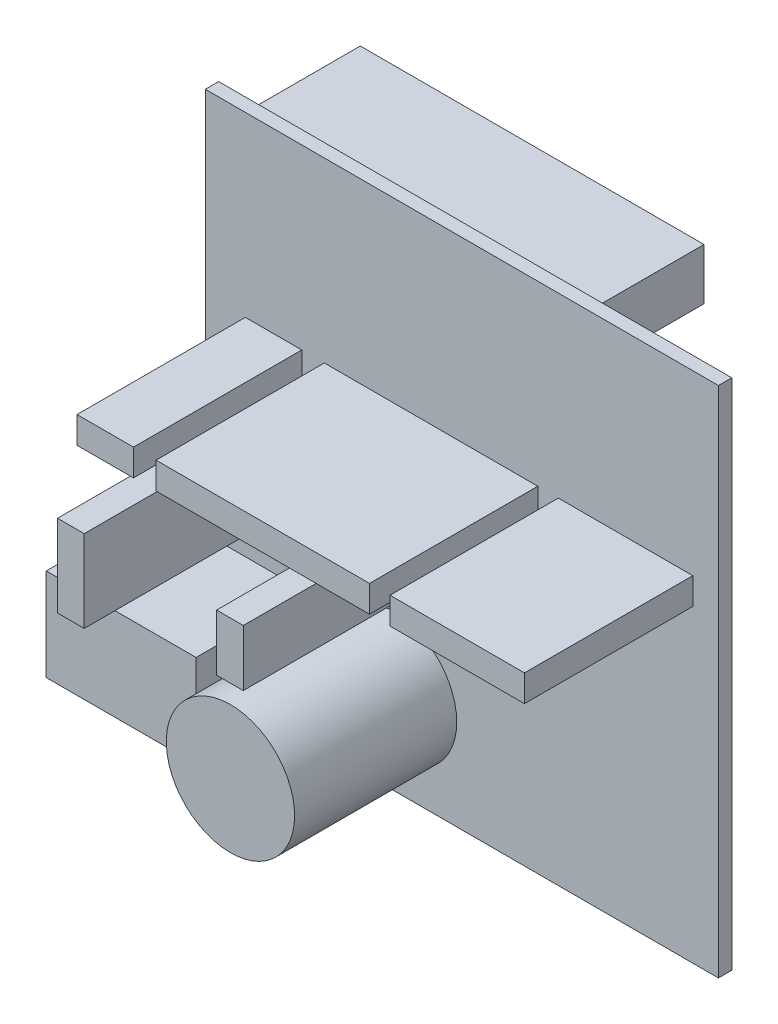
ISO-10303-21;
HEADER;
FILE_DESCRIPTION(('STEP AP214'),'2;1');
FILE_NAME('part.step','',(''),(''),'','','');
FILE_SCHEMA(('AUTOMOTIVE_DESIGN { 1 0 10303 214 1 1 1 1 }'));
ENDSEC;
DATA;
#1=APPLICATION_CONTEXT('core data for automotive mechanical design processes');
#2=APPLICATION_PROTOCOL_DEFINITION('international standard','automotive_design',2000,#1);
#3=PRODUCT_CONTEXT('',#1,'mechanical');
#4=PRODUCT('Part','Part','',(#3));
#5=PRODUCT_RELATED_PRODUCT_CATEGORY('part','',(#4));
#6=PRODUCT_DEFINITION_FORMATION('','',#4);
#7=PRODUCT_DEFINITION_CONTEXT('part definition',#1,'design');
#8=PRODUCT_DEFINITION('design','',#6,#7);
#9=PRODUCT_DEFINITION_SHAPE('','',#8);
#10=(LENGTH_UNIT() NAMED_UNIT(*) SI_UNIT(.MILLI.,.METRE.));
#11=(NAMED_UNIT(*) PLANE_ANGLE_UNIT() SI_UNIT($,.RADIAN.));
#12=(NAMED_UNIT(*) SI_UNIT($,.STERADIAN.) SOLID_ANGLE_UNIT());
#13=UNCERTAINTY_MEASURE_WITH_UNIT(LENGTH_MEASURE(1.E-05),#10,'distance_accuracy_value','');
#14=(GEOMETRIC_REPRESENTATION_CONTEXT(3) GLOBAL_UNCERTAINTY_ASSIGNED_CONTEXT((#13)) GLOBAL_UNIT_ASSIGNED_CONTEXT((#10,
#11,#12)) REPRESENTATION_CONTEXT('',''));
#15=CARTESIAN_POINT('',(0.,0.,0.));
#16=DIRECTION('',(0.,0.,1.));
#17=DIRECTION('',(1.,0.,0.));
#18=AXIS2_PLACEMENT_3D('',#15,#16,#17);
#19=CARTESIAN_POINT('',(0.,-50.,1.3));
#20=DIRECTION('',(0.,0.,1.));
#21=DIRECTION('',(1.,0.,0.));
#22=AXIS2_PLACEMENT_3D('',#19,#20,#21);
#23=PLANE('',#22);
#24=DIRECTION('',(1.,0.,0.));
#25=VECTOR('',#24,1.);
#26=CARTESIAN_POINT('',(2.,-35.,1.3));
#27=LINE('',#26,#25);
#28=CARTESIAN_POINT('',(2.,-35.,1.3));
#29=VERTEX_POINT('',#28);
#30=CARTESIAN_POINT('',(4.6,-35.,1.3));
#31=VERTEX_POINT('',#30);
#32=EDGE_CURVE('E277',#29,#31,#27,.T.);
#33=ORIENTED_EDGE('',*,*,#32,.F.);
#34=DIRECTION('',(0.,-1.,0.));
#35=VECTOR('',#34,1.);
#36=CARTESIAN_POINT('',(2.,-27.,1.3));
#37=LINE('',#36,#35);
#38=CARTESIAN_POINT('',(2.,-27.,1.3));
#39=VERTEX_POINT('',#38);
#40=EDGE_CURVE('E274',#39,#29,#37,.T.);
#41=ORIENTED_EDGE('',*,*,#40,.F.);
#42=DIRECTION('',(-1.,0.,0.));
#43=VECTOR('',#42,1.);
#44=CARTESIAN_POINT('',(2.,-27.,1.3));
#45=LINE('',#44,#43);
#46=CARTESIAN_POINT('',(4.6,-27.,1.3));
#47=VERTEX_POINT('',#46);
#48=EDGE_CURVE('E286',#47,#39,#45,.T.);
#49=ORIENTED_EDGE('',*,*,#48,.F.);
#50=DIRECTION('',(0.,1.,0.));
#51=VECTOR('',#50,1.);
#52=CARTESIAN_POINT('',(4.6,-27.,1.3));
#53=LINE('',#52,#51);
#54=EDGE_CURVE('E294',#31,#47,#53,.T.);
#55=ORIENTED_EDGE('',*,*,#54,.F.);
#56=EDGE_LOOP('',(#33,#41,#49,#55));
#57=FACE_BOUND('',#56,.T.);
#58=DIRECTION('',(-1.,0.,0.));
#59=VECTOR('',#58,1.);
#60=CARTESIAN_POINT('',(32.4,-17.3,1.3));
#61=LINE('',#60,#59);
#62=CARTESIAN_POINT('',(32.4,-17.3,1.3));
#63=VERTEX_POINT('',#62);
#64=CARTESIAN_POINT('',(11.6,-17.3,1.3));
#65=VERTEX_POINT('',#64);
#66=EDGE_CURVE('E348',#63,#65,#61,.T.);
#67=ORIENTED_EDGE('',*,*,#66,.F.);
#68=DIRECTION('',(0.,1.,0.));
#69=VECTOR('',#68,1.);
#70=CARTESIAN_POINT('',(32.4,-17.3,1.3));
#71=LINE('',#70,#69);
#72=CARTESIAN_POINT('',(32.4,-19.9,1.3));
#73=VERTEX_POINT('',#72);
#74=EDGE_CURVE('E334',#73,#63,#71,.T.);
#75=ORIENTED_EDGE('',*,*,#74,.F.);
#76=DIRECTION('',(1.,0.,0.));
#77=VECTOR('',#76,1.);
#78=CARTESIAN_POINT('',(32.4,-19.9,1.3));
#79=LINE('',#78,#77);
#80=CARTESIAN_POINT('',(11.6,-19.9,1.3));
#81=VERTEX_POINT('',#80);
#82=EDGE_CURVE('E339',#81,#73,#79,.T.);
#83=ORIENTED_EDGE('',*,*,#82,.F.);
#84=DIRECTION('',(0.,-1.,0.));
#85=VECTOR('',#84,1.);
#86=CARTESIAN_POINT('',(11.6,-17.3,1.3));
#87=LINE('',#86,#85);
#88=EDGE_CURVE('E350',#65,#81,#87,.T.);
#89=ORIENTED_EDGE('',*,*,#88,.F.);
#90=EDGE_LOOP('',(#67,#75,#83,#89));
#91=FACE_BOUND('',#90,.T.);
#92=CARTESIAN_POINT('',(18.25,-41.15,1.3));
#93=DIRECTION('',(0.,0.,1.));
#94=DIRECTION('',(1.,0.,0.));
#95=AXIS2_PLACEMENT_3D('',#92,#93,#94);
#96=CIRCLE('',#95,6.25);
#97=CARTESIAN_POINT('',(24.5,-41.15,1.3));
#98=VERTEX_POINT('',#97);
#99=EDGE_CURVE('E392',#98,#98,#96,.T.);
#100=ORIENTED_EDGE('',*,*,#99,.F.);
#101=EDGE_LOOP('',(#100));
#102=FACE_BOUND('',#101,.T.);
#103=DIRECTION('',(-1.,0.,0.));
#104=VECTOR('',#103,1.);
#105=CARTESIAN_POINT('',(-4.6,-37.5,1.3));
#106=LINE('',#105,#104);
#107=CARTESIAN_POINT('',(10.,-37.5,1.3));
#108=VERTEX_POINT('',#107);
#109=CARTESIAN_POINT('',(0.,-37.5,1.3));
#110=VERTEX_POINT('',#109);
#111=EDGE_CURVE('E403',#108,#110,#106,.T.);
#112=ORIENTED_EDGE('',*,*,#111,.F.);
#113=DIRECTION('',(0.,1.,0.));
#114=VECTOR('',#113,1.);
#115=CARTESIAN_POINT('',(10.,-46.5,1.3));
#116=LINE('',#115,#114);
#117=CARTESIAN_POINT('',(10.,-46.5,1.3));
#118=VERTEX_POINT('',#117);
#119=EDGE_CURVE('E413',#118,#108,#116,.T.);
#120=ORIENTED_EDGE('',*,*,#119,.F.);
#121=DIRECTION('',(1.,0.,0.));
#122=VECTOR('',#121,1.);
#123=CARTESIAN_POINT('',(-4.6,-46.5,1.3));
#124=LINE('',#123,#122);
#125=CARTESIAN_POINT('',(0.,-46.5,1.3));
#126=VERTEX_POINT('',#125);
#127=EDGE_CURVE('E11',#126,#118,#124,.T.);
#128=ORIENTED_EDGE('',*,*,#127,.F.);
#129=DIRECTION('',(0.,-1.,0.));
#130=VECTOR('',#129,1.);
#131=CARTESIAN_POINT('',(0.,0.,1.3));
#132=LINE('',#131,#130);
#133=CARTESIAN_POINT('',(0.,-50.,1.3));
#134=VERTEX_POINT('',#133);
#135=EDGE_CURVE('E469',#126,#134,#132,.T.);
#136=ORIENTED_EDGE('',*,*,#135,.T.);
#137=DIRECTION('',(1.,0.,0.));
#138=VECTOR('',#137,1.);
#139=CARTESIAN_POINT('',(0.,-50.,1.3));
#140=LINE('',#139,#138);
#141=CARTESIAN_POINT('',(50.,-50.,1.3));
#142=VERTEX_POINT('',#141);
#143=EDGE_CURVE('E467',#134,#142,#140,.T.);
#144=ORIENTED_EDGE('',*,*,#143,.T.);
#145=DIRECTION('',(0.,1.,0.));
#146=VECTOR('',#145,1.);
#147=CARTESIAN_POINT('',(50.,0.,1.3));
#148=LINE('',#147,#146);
#149=CARTESIAN_POINT('',(50.,0.,1.3));
#150=VERTEX_POINT('',#149);
#151=EDGE_CURVE('E471',#142,#150,#148,.T.);
#152=ORIENTED_EDGE('',*,*,#151,.T.);
#153=DIRECTION('',(-1.,0.,0.));
#154=VECTOR('',#153,1.);
#155=CARTESIAN_POINT('',(0.,0.,1.3));
#156=LINE('',#155,#154);
#157=CARTESIAN_POINT('',(0.,0.,1.3));
#158=VERTEX_POINT('',#157);
#159=EDGE_CURVE('E473',#150,#158,#156,.T.);
#160=ORIENTED_EDGE('',*,*,#159,.T.);
#161=EDGE_CURVE('E464',#158,#110,#132,.T.);
#162=ORIENTED_EDGE('',*,*,#161,.T.);
#163=EDGE_LOOP('',(#112,#120,#128,#136,#144,#152,#160,#162));
#164=FACE_BOUND('',#163,.T.);
#165=DIRECTION('',(-1.,0.,0.));
#166=VECTOR('',#165,1.);
#167=CARTESIAN_POINT('',(47.5,-17.3,1.3));
#168=LINE('',#167,#166);
#169=CARTESIAN_POINT('',(47.5,-17.3,1.3));
#170=VERTEX_POINT('',#169);
#171=CARTESIAN_POINT('',(34.4,-17.3,1.3));
#172=VERTEX_POINT('',#171);
#173=EDGE_CURVE('E377',#170,#172,#168,.T.);
#174=ORIENTED_EDGE('',*,*,#173,.F.);
#175=DIRECTION('',(0.,1.,0.));
#176=VECTOR('',#175,1.);
#177=CARTESIAN_POINT('',(47.5,-17.3,1.3));
#178=LINE('',#177,#176);
#179=CARTESIAN_POINT('',(47.5,-19.9,1.3));
#180=VERTEX_POINT('',#179);
#181=EDGE_CURVE('E363',#180,#170,#178,.T.);
#182=ORIENTED_EDGE('',*,*,#181,.F.);
#183=DIRECTION('',(1.,0.,0.));
#184=VECTOR('',#183,1.);
#185=CARTESIAN_POINT('',(47.5,-19.9,1.3));
#186=LINE('',#185,#184);
#187=CARTESIAN_POINT('',(34.4,-19.9,1.3));
#188=VERTEX_POINT('',#187);
#189=EDGE_CURVE('E368',#188,#180,#186,.T.);
#190=ORIENTED_EDGE('',*,*,#189,.F.);
#191=DIRECTION('',(0.,-1.,0.));
#192=VECTOR('',#191,1.);
#193=CARTESIAN_POINT('',(34.4,-17.3,1.3));
#194=LINE('',#193,#192);
#195=EDGE_CURVE('E379',#172,#188,#194,.T.);
#196=ORIENTED_EDGE('',*,*,#195,.F.);
#197=EDGE_LOOP('',(#174,#182,#190,#196));
#198=FACE_BOUND('',#197,.T.);
#199=DIRECTION('',(-1.,0.,0.));
#200=VECTOR('',#199,1.);
#201=CARTESIAN_POINT('',(9.40000000000001,-17.3,1.3));
#202=LINE('',#201,#200);
#203=CARTESIAN_POINT('',(9.40000000000001,-17.3,1.3));
#204=VERTEX_POINT('',#203);
#205=CARTESIAN_POINT('',(3.90000000000001,-17.3,1.3));
#206=VERTEX_POINT('',#205);
#207=EDGE_CURVE('E319',#204,#206,#202,.T.);
#208=ORIENTED_EDGE('',*,*,#207,.F.);
#209=DIRECTION('',(0.,1.,0.));
#210=VECTOR('',#209,1.);
#211=CARTESIAN_POINT('',(9.40000000000001,-17.3,1.3));
#212=LINE('',#211,#210);
#213=CARTESIAN_POINT('',(9.40000000000001,-19.9,1.3));
#214=VERTEX_POINT('',#213);
#215=EDGE_CURVE('E305',#214,#204,#212,.T.);
#216=ORIENTED_EDGE('',*,*,#215,.F.);
#217=DIRECTION('',(1.,0.,0.));
#218=VECTOR('',#217,1.);
#219=CARTESIAN_POINT('',(9.40000000000001,-19.9,1.3));
#220=LINE('',#219,#218);
#221=CARTESIAN_POINT('',(3.90000000000001,-19.9,1.3));
#222=VERTEX_POINT('',#221);
#223=EDGE_CURVE('E310',#222,#214,#220,.T.);
#224=ORIENTED_EDGE('',*,*,#223,.F.);
#225=DIRECTION('',(0.,-1.,0.));
#226=VECTOR('',#225,1.);
#227=CARTESIAN_POINT('',(3.90000000000001,-17.3,1.3));
#228=LINE('',#227,#226);
#229=EDGE_CURVE('E321',#206,#222,#228,.T.);
#230=ORIENTED_EDGE('',*,*,#229,.F.);
#231=EDGE_LOOP('',(#208,#216,#224,#230));
#232=FACE_BOUND('',#231,.T.);
#233=DIRECTION('',(1.,0.,0.));
#234=VECTOR('',#233,1.);
#235=CARTESIAN_POINT('',(17.5,-32.5,1.3));
#236=LINE('',#235,#234);
#237=CARTESIAN_POINT('',(17.5,-32.5,1.3));
#238=VERTEX_POINT('',#237);
#239=CARTESIAN_POINT('',(20.1,-32.5,1.3));
#240=VERTEX_POINT('',#239);
#241=EDGE_CURVE('E933',#238,#240,#236,.T.);
#242=ORIENTED_EDGE('',*,*,#241,.F.);
#243=DIRECTION('',(0.,-1.,0.));
#244=VECTOR('',#243,1.);
#245=CARTESIAN_POINT('',(17.5,-27.,1.3));
#246=LINE('',#245,#244);
#247=CARTESIAN_POINT('',(17.5,-27.,1.3));
#248=VERTEX_POINT('',#247);
#249=EDGE_CURVE('E272',#248,#238,#246,.T.);
#250=ORIENTED_EDGE('',*,*,#249,.F.);
#251=DIRECTION('',(-1.,0.,0.));
#252=VECTOR('',#251,1.);
#253=CARTESIAN_POINT('',(17.5,-27.,1.3));
#254=LINE('',#253,#252);
#255=CARTESIAN_POINT('',(20.1,-27.,1.3));
#256=VERTEX_POINT('',#255);
#257=EDGE_CURVE('E268',#256,#248,#254,.T.);
#258=ORIENTED_EDGE('',*,*,#257,.F.);
#259=DIRECTION('',(0.,1.,0.));
#260=VECTOR('',#259,1.);
#261=CARTESIAN_POINT('',(20.1,-27.,1.3));
#262=LINE('',#261,#260);
#263=EDGE_CURVE('E930',#240,#256,#262,.T.);
#264=ORIENTED_EDGE('',*,*,#263,.F.);
#265=EDGE_LOOP('',(#242,#250,#258,#264));
#266=FACE_BOUND('',#265,.T.);
#267=ADVANCED_FACE('F31',(#57,#91,#102,#164,#198,#232,#266),#23,.T.);
#268=CARTESIAN_POINT('',(0.,-50.,0.));
#269=DIRECTION('',(0.,0.,1.));
#270=DIRECTION('',(1.,0.,0.));
#271=AXIS2_PLACEMENT_3D('',#268,#269,#270);
#272=PLANE('',#271);
#273=DIRECTION('',(0.,-1.,0.));
#274=VECTOR('',#273,1.);
#275=CARTESIAN_POINT('',(0.,0.,0.));
#276=LINE('',#275,#274);
#277=CARTESIAN_POINT('',(0.,0.,0.));
#278=VERTEX_POINT('',#277);
#279=CARTESIAN_POINT('',(0.,-50.,0.));
#280=VERTEX_POINT('',#279);
#281=EDGE_CURVE('E463',#278,#280,#276,.T.);
#282=ORIENTED_EDGE('',*,*,#281,.F.);
#283=DIRECTION('',(-1.,0.,0.));
#284=VECTOR('',#283,1.);
#285=CARTESIAN_POINT('',(0.,0.,0.));
#286=LINE('',#285,#284);
#287=CARTESIAN_POINT('',(50.,0.,0.));
#288=VERTEX_POINT('',#287);
#289=EDGE_CURVE('E482',#288,#278,#286,.T.);
#290=ORIENTED_EDGE('',*,*,#289,.F.);
#291=DIRECTION('',(0.,1.,0.));
#292=VECTOR('',#291,1.);
#293=CARTESIAN_POINT('',(50.,0.,0.));
#294=LINE('',#293,#292);
#295=CARTESIAN_POINT('',(50.,-50.,0.));
#296=VERTEX_POINT('',#295);
#297=EDGE_CURVE('E480',#296,#288,#294,.T.);
#298=ORIENTED_EDGE('',*,*,#297,.F.);
#299=DIRECTION('',(1.,0.,0.));
#300=VECTOR('',#299,1.);
#301=CARTESIAN_POINT('',(0.,-50.,0.));
#302=LINE('',#301,#300);
#303=EDGE_CURVE('E478',#280,#296,#302,.T.);
#304=ORIENTED_EDGE('',*,*,#303,.F.);
#305=EDGE_LOOP('',(#282,#290,#298,#304));
#306=FACE_BOUND('',#305,.T.);
#307=DIRECTION('',(0.,1.,0.));
#308=VECTOR('',#307,1.);
#309=CARTESIAN_POINT('',(2.7,-1.2,0.));
#310=LINE('',#309,#308);
#311=CARTESIAN_POINT('',(2.7,-6.2,0.));
#312=VERTEX_POINT('',#311);
#313=CARTESIAN_POINT('',(2.7,-1.2,0.));
#314=VERTEX_POINT('',#313);
#315=EDGE_CURVE('E430',#312,#314,#310,.T.);
#316=ORIENTED_EDGE('',*,*,#315,.F.);
#317=DIRECTION('',(-1.,0.,0.));
#318=VECTOR('',#317,1.);
#319=CARTESIAN_POINT('',(2.7,-6.2,0.));
#320=LINE('',#319,#318);
#321=CARTESIAN_POINT('',(36.2,-6.2,0.));
#322=VERTEX_POINT('',#321);
#323=EDGE_CURVE('E435',#322,#312,#320,.T.);
#324=ORIENTED_EDGE('',*,*,#323,.F.);
#325=DIRECTION('',(0.,-1.,0.));
#326=VECTOR('',#325,1.);
#327=CARTESIAN_POINT('',(36.2,-1.2,0.));
#328=LINE('',#327,#326);
#329=CARTESIAN_POINT('',(36.2,-1.20000000000001,0.));
#330=VERTEX_POINT('',#329);
#331=EDGE_CURVE('E447',#330,#322,#328,.T.);
#332=ORIENTED_EDGE('',*,*,#331,.F.);
#333=DIRECTION('',(1.,0.,0.));
#334=VECTOR('',#333,1.);
#335=CARTESIAN_POINT('',(2.7,-1.2,0.));
#336=LINE('',#335,#334);
#337=EDGE_CURVE('E444',#314,#330,#336,.T.);
#338=ORIENTED_EDGE('',*,*,#337,.F.);
#339=EDGE_LOOP('',(#316,#324,#332,#338));
#340=FACE_BOUND('',#339,.T.);
#341=ADVANCED_FACE('F506',(#306,#340),#272,.F.);
#342=CARTESIAN_POINT('',(0.,0.,1.3));
#343=DIRECTION('',(1.,0.,0.));
#344=DIRECTION('',(0.,1.,0.));
#345=AXIS2_PLACEMENT_3D('',#342,#343,#344);
#346=PLANE('',#345);
#347=ORIENTED_EDGE('',*,*,#281,.T.);
#348=DIRECTION('',(0.,0.,-1.));
#349=VECTOR('',#348,1.);
#350=CARTESIAN_POINT('',(0.,-50.,1.3));
#351=LINE('',#350,#349);
#352=EDGE_CURVE('E35',#134,#280,#351,.T.);
#353=ORIENTED_EDGE('',*,*,#352,.F.);
#354=ORIENTED_EDGE('',*,*,#135,.F.);
#355=EDGE_CURVE('E468',#110,#126,#132,.T.);
#356=ORIENTED_EDGE('',*,*,#355,.F.);
#357=ORIENTED_EDGE('',*,*,#161,.F.);
#358=DIRECTION('',(0.,0.,-1.));
#359=VECTOR('',#358,1.);
#360=CARTESIAN_POINT('',(0.,0.,1.3));
#361=LINE('',#360,#359);
#362=EDGE_CURVE('E475',#158,#278,#361,.T.);
#363=ORIENTED_EDGE('',*,*,#362,.T.);
#364=EDGE_LOOP('',(#347,#353,#354,#356,#357,#363));
#365=FACE_BOUND('',#364,.T.);
#366=ADVANCED_FACE('F33',(#365),#346,.F.);
#367=CARTESIAN_POINT('',(0.,-50.,1.3));
#368=DIRECTION('',(0.,1.,0.));
#369=DIRECTION('',(0.,0.,1.));
#370=AXIS2_PLACEMENT_3D('',#367,#368,#369);
#371=PLANE('',#370);
#372=ORIENTED_EDGE('',*,*,#303,.T.);
#373=DIRECTION('',(0.,0.,-1.));
#374=VECTOR('',#373,1.);
#375=CARTESIAN_POINT('',(50.,-50.,1.3));
#376=LINE('',#375,#374);
#377=EDGE_CURVE('E488',#142,#296,#376,.T.);
#378=ORIENTED_EDGE('',*,*,#377,.F.);
#379=ORIENTED_EDGE('',*,*,#143,.F.);
#380=ORIENTED_EDGE('',*,*,#352,.T.);
#381=EDGE_LOOP('',(#372,#378,#379,#380));
#382=FACE_BOUND('',#381,.T.);
#383=ADVANCED_FACE('F498',(#382),#371,.F.);
#384=CARTESIAN_POINT('',(50.,0.,1.3));
#385=DIRECTION('',(-1.,0.,0.));
#386=DIRECTION('',(0.,-1.,0.));
#387=AXIS2_PLACEMENT_3D('',#384,#385,#386);
#388=PLANE('',#387);
#389=ORIENTED_EDGE('',*,*,#297,.T.);
#390=DIRECTION('',(0.,0.,-1.));
#391=VECTOR('',#390,1.);
#392=CARTESIAN_POINT('',(50.,0.,1.3));
#393=LINE('',#392,#391);
#394=EDGE_CURVE('E486',#150,#288,#393,.T.);
#395=ORIENTED_EDGE('',*,*,#394,.F.);
#396=ORIENTED_EDGE('',*,*,#151,.F.);
#397=ORIENTED_EDGE('',*,*,#377,.T.);
#398=EDGE_LOOP('',(#389,#395,#396,#397));
#399=FACE_BOUND('',#398,.T.);
#400=ADVANCED_FACE('F509',(#399),#388,.F.);
#401=CARTESIAN_POINT('',(0.,0.,1.3));
#402=DIRECTION('',(0.,-1.,0.));
#403=DIRECTION('',(0.,0.,-1.));
#404=AXIS2_PLACEMENT_3D('',#401,#402,#403);
#405=PLANE('',#404);
#406=ORIENTED_EDGE('',*,*,#289,.T.);
#407=ORIENTED_EDGE('',*,*,#362,.F.);
#408=ORIENTED_EDGE('',*,*,#159,.F.);
#409=ORIENTED_EDGE('',*,*,#394,.T.);
#410=EDGE_LOOP('',(#406,#407,#408,#409));
#411=FACE_BOUND('',#410,.T.);
#412=ADVANCED_FACE('F512',(#411),#405,.F.);
#413=CARTESIAN_POINT('',(2.7,-1.2,-11.1));
#414=DIRECTION('',(1.,0.,0.));
#415=DIRECTION('',(0.,1.,0.));
#416=AXIS2_PLACEMENT_3D('',#413,#414,#415);
#417=PLANE('',#416);
#418=ORIENTED_EDGE('',*,*,#315,.T.);
#419=DIRECTION('',(0.,0.,1.));
#420=VECTOR('',#419,1.);
#421=CARTESIAN_POINT('',(2.7,-1.2,-11.1));
#422=LINE('',#421,#420);
#423=CARTESIAN_POINT('',(2.7,-1.2,-11.1));
#424=VERTEX_POINT('',#423);
#425=EDGE_CURVE('E460',#424,#314,#422,.T.);
#426=ORIENTED_EDGE('',*,*,#425,.F.);
#427=DIRECTION('',(0.,1.,0.));
#428=VECTOR('',#427,1.);
#429=CARTESIAN_POINT('',(2.7,-1.2,-11.1));
#430=LINE('',#429,#428);
#431=CARTESIAN_POINT('',(2.7,-6.2,-11.1));
#432=VERTEX_POINT('',#431);
#433=EDGE_CURVE('E431',#432,#424,#430,.T.);
#434=ORIENTED_EDGE('',*,*,#433,.F.);
#435=DIRECTION('',(0.,0.,1.));
#436=VECTOR('',#435,1.);
#437=CARTESIAN_POINT('',(2.7,-6.2,-11.1));
#438=LINE('',#437,#436);
#439=EDGE_CURVE('E441',#432,#312,#438,.T.);
#440=ORIENTED_EDGE('',*,*,#439,.T.);
#441=EDGE_LOOP('',(#418,#426,#434,#440));
#442=FACE_BOUND('',#441,.T.);
#443=ADVANCED_FACE('F557',(#442),#417,.F.);
#444=CARTESIAN_POINT('',(2.7,-1.2,-11.1));
#445=DIRECTION('',(0.,-1.,0.));
#446=DIRECTION('',(1.,0.,0.));
#447=AXIS2_PLACEMENT_3D('',#444,#445,#446);
#448=PLANE('',#447);
#449=ORIENTED_EDGE('',*,*,#337,.T.);
#450=DIRECTION('',(0.,0.,1.));
#451=VECTOR('',#450,1.);
#452=CARTESIAN_POINT('',(36.2,-1.2,-11.1));
#453=LINE('',#452,#451);
#454=CARTESIAN_POINT('',(36.2,-1.2,-11.1));
#455=VERTEX_POINT('',#454);
#456=EDGE_CURVE('E457',#455,#330,#453,.T.);
#457=ORIENTED_EDGE('',*,*,#456,.F.);
#458=DIRECTION('',(1.,0.,0.));
#459=VECTOR('',#458,1.);
#460=CARTESIAN_POINT('',(2.7,-1.2,-11.1));
#461=LINE('',#460,#459);
#462=EDGE_CURVE('E434',#424,#455,#461,.T.);
#463=ORIENTED_EDGE('',*,*,#462,.F.);
#464=ORIENTED_EDGE('',*,*,#425,.T.);
#465=EDGE_LOOP('',(#449,#457,#463,#464));
#466=FACE_BOUND('',#465,.T.);
#467=ADVANCED_FACE('F588',(#466),#448,.F.);
#468=CARTESIAN_POINT('',(36.2,-1.2,-11.1));
#469=DIRECTION('',(-1.,0.,0.));
#470=DIRECTION('',(0.,0.,1.));
#471=AXIS2_PLACEMENT_3D('',#468,#469,#470);
#472=PLANE('',#471);
#473=ORIENTED_EDGE('',*,*,#331,.T.);
#474=DIRECTION('',(0.,0.,1.));
#475=VECTOR('',#474,1.);
#476=CARTESIAN_POINT('',(36.2,-6.2,-11.1));
#477=LINE('',#476,#475);
#478=CARTESIAN_POINT('',(36.2,-6.2,-11.1));
#479=VERTEX_POINT('',#478);
#480=EDGE_CURVE('E454',#479,#322,#477,.T.);
#481=ORIENTED_EDGE('',*,*,#480,.F.);
#482=DIRECTION('',(0.,-1.,0.));
#483=VECTOR('',#482,1.);
#484=CARTESIAN_POINT('',(36.2,-1.2,-11.1));
#485=LINE('',#484,#483);
#486=EDGE_CURVE('E437',#455,#479,#485,.T.);
#487=ORIENTED_EDGE('',*,*,#486,.F.);
#488=ORIENTED_EDGE('',*,*,#456,.T.);
#489=EDGE_LOOP('',(#473,#481,#487,#488));
#490=FACE_BOUND('',#489,.T.);
#491=ADVANCED_FACE('F597',(#490),#472,.F.);
#492=CARTESIAN_POINT('',(2.7,-6.2,-11.1));
#493=DIRECTION('',(0.,1.,0.));
#494=DIRECTION('',(-1.,0.,0.));
#495=AXIS2_PLACEMENT_3D('',#492,#493,#494);
#496=PLANE('',#495);
#497=ORIENTED_EDGE('',*,*,#323,.T.);
#498=ORIENTED_EDGE('',*,*,#439,.F.);
#499=DIRECTION('',(-1.,0.,0.));
#500=VECTOR('',#499,1.);
#501=CARTESIAN_POINT('',(2.7,-6.2,-11.1));
#502=LINE('',#501,#500);
#503=EDGE_CURVE('E439',#479,#432,#502,.T.);
#504=ORIENTED_EDGE('',*,*,#503,.F.);
#505=ORIENTED_EDGE('',*,*,#480,.T.);
#506=EDGE_LOOP('',(#497,#498,#504,#505));
#507=FACE_BOUND('',#506,.T.);
#508=ADVANCED_FACE('F606',(#507),#496,.F.);
#509=CARTESIAN_POINT('',(2.7,-6.2,-11.1));
#510=DIRECTION('',(0.,0.,1.));
#511=DIRECTION('',(1.,0.,0.));
#512=AXIS2_PLACEMENT_3D('',#509,#510,#511);
#513=PLANE('',#512);
#514=ORIENTED_EDGE('',*,*,#433,.T.);
#515=ORIENTED_EDGE('',*,*,#462,.T.);
#516=ORIENTED_EDGE('',*,*,#486,.T.);
#517=ORIENTED_EDGE('',*,*,#503,.T.);
#518=EDGE_LOOP('',(#514,#515,#516,#517));
#519=FACE_BOUND('',#518,.T.);
#520=ADVANCED_FACE('F615',(#519),#513,.F.);
#521=CARTESIAN_POINT('',(-4.6,-46.5,12.2));
#522=DIRECTION('',(1.,0.,0.));
#523=DIRECTION('',(0.,0.,-1.));
#524=AXIS2_PLACEMENT_3D('',#521,#522,#523);
#525=PLANE('',#524);
#526=DIRECTION('',(0.,-1.,0.));
#527=VECTOR('',#526,1.);
#528=CARTESIAN_POINT('',(-4.6,-46.5,1.3));
#529=LINE('',#528,#527);
#530=CARTESIAN_POINT('',(-4.6,-37.5,1.3));
#531=VERTEX_POINT('',#530);
#532=CARTESIAN_POINT('',(-4.6,-46.5,1.3));
#533=VERTEX_POINT('',#532);
#534=EDGE_CURVE('E396',#531,#533,#529,.T.);
#535=ORIENTED_EDGE('',*,*,#534,.T.);
#536=DIRECTION('',(0.,0.,-1.));
#537=VECTOR('',#536,1.);
#538=CARTESIAN_POINT('',(-4.6,-46.5,12.2));
#539=LINE('',#538,#537);
#540=CARTESIAN_POINT('',(-4.6,-46.5,12.2));
#541=VERTEX_POINT('',#540);
#542=EDGE_CURVE('E427',#541,#533,#539,.T.);
#543=ORIENTED_EDGE('',*,*,#542,.F.);
#544=DIRECTION('',(0.,-1.,0.));
#545=VECTOR('',#544,1.);
#546=CARTESIAN_POINT('',(-4.6,-46.5,12.2));
#547=LINE('',#546,#545);
#548=CARTESIAN_POINT('',(-4.6,-37.5,12.2));
#549=VERTEX_POINT('',#548);
#550=EDGE_CURVE('E399',#549,#541,#547,.T.);
#551=ORIENTED_EDGE('',*,*,#550,.F.);
#552=DIRECTION('',(0.,0.,-1.));
#553=VECTOR('',#552,1.);
#554=CARTESIAN_POINT('',(-4.6,-37.5,12.2));
#555=LINE('',#554,#553);
#556=EDGE_CURVE('E409',#549,#531,#555,.T.);
#557=ORIENTED_EDGE('',*,*,#556,.T.);
#558=EDGE_LOOP('',(#535,#543,#551,#557));
#559=FACE_BOUND('',#558,.T.);
#560=ADVANCED_FACE('F526',(#559),#525,.F.);
#561=CARTESIAN_POINT('',(-4.6,-46.5,12.2));
#562=DIRECTION('',(0.,1.,0.));
#563=DIRECTION('',(0.,0.,1.));
#564=AXIS2_PLACEMENT_3D('',#561,#562,#563);
#565=PLANE('',#564);
#566=EDGE_CURVE('E41',#533,#126,#124,.T.);
#567=ORIENTED_EDGE('',*,*,#566,.T.);
#568=ORIENTED_EDGE('',*,*,#127,.T.);
#569=DIRECTION('',(0.,0.,-1.));
#570=VECTOR('',#569,1.);
#571=CARTESIAN_POINT('',(10.,-46.5,12.2));
#572=LINE('',#571,#570);
#573=CARTESIAN_POINT('',(10.,-46.5,12.2));
#574=VERTEX_POINT('',#573);
#575=EDGE_CURVE('E424',#574,#118,#572,.T.);
#576=ORIENTED_EDGE('',*,*,#575,.F.);
#577=DIRECTION('',(1.,0.,0.));
#578=VECTOR('',#577,1.);
#579=CARTESIAN_POINT('',(-4.6,-46.5,12.2));
#580=LINE('',#579,#578);
#581=EDGE_CURVE('E402',#541,#574,#580,.T.);
#582=ORIENTED_EDGE('',*,*,#581,.F.);
#583=ORIENTED_EDGE('',*,*,#542,.T.);
#584=EDGE_LOOP('',(#567,#568,#576,#582,#583));
#585=FACE_BOUND('',#584,.T.);
#586=ADVANCED_FACE('F521',(#585),#565,.F.);
#587=CARTESIAN_POINT('',(10.,-46.5,12.2));
#588=DIRECTION('',(-1.,0.,0.));
#589=DIRECTION('',(0.,0.,1.));
#590=AXIS2_PLACEMENT_3D('',#587,#588,#589);
#591=PLANE('',#590);
#592=ORIENTED_EDGE('',*,*,#119,.T.);
#593=DIRECTION('',(0.,0.,-1.));
#594=VECTOR('',#593,1.);
#595=CARTESIAN_POINT('',(10.,-37.5,12.2));
#596=LINE('',#595,#594);
#597=CARTESIAN_POINT('',(10.,-37.5,12.2));
#598=VERTEX_POINT('',#597);
#599=EDGE_CURVE('E421',#598,#108,#596,.T.);
#600=ORIENTED_EDGE('',*,*,#599,.F.);
#601=DIRECTION('',(0.,1.,0.));
#602=VECTOR('',#601,1.);
#603=CARTESIAN_POINT('',(10.,-46.5,12.2));
#604=LINE('',#603,#602);
#605=EDGE_CURVE('E405',#574,#598,#604,.T.);
#606=ORIENTED_EDGE('',*,*,#605,.F.);
#607=ORIENTED_EDGE('',*,*,#575,.T.);
#608=EDGE_LOOP('',(#592,#600,#606,#607));
#609=FACE_BOUND('',#608,.T.);
#610=ADVANCED_FACE('F533',(#609),#591,.F.);
#611=CARTESIAN_POINT('',(-4.6,-37.5,12.2));
#612=DIRECTION('',(0.,-1.,0.));
#613=DIRECTION('',(0.,0.,-1.));
#614=AXIS2_PLACEMENT_3D('',#611,#612,#613);
#615=PLANE('',#614);
#616=ORIENTED_EDGE('',*,*,#111,.T.);
#617=EDGE_CURVE('E416',#110,#531,#106,.T.);
#618=ORIENTED_EDGE('',*,*,#617,.T.);
#619=ORIENTED_EDGE('',*,*,#556,.F.);
#620=DIRECTION('',(-1.,0.,0.));
#621=VECTOR('',#620,1.);
#622=CARTESIAN_POINT('',(-4.6,-37.5,12.2));
#623=LINE('',#622,#621);
#624=EDGE_CURVE('E407',#598,#549,#623,.T.);
#625=ORIENTED_EDGE('',*,*,#624,.F.);
#626=ORIENTED_EDGE('',*,*,#599,.T.);
#627=EDGE_LOOP('',(#616,#618,#619,#625,#626));
#628=FACE_BOUND('',#627,.T.);
#629=ADVANCED_FACE('F530',(#628),#615,.F.);
#630=CARTESIAN_POINT('',(-4.6,-37.5,12.2));
#631=DIRECTION('',(0.,0.,-1.));
#632=DIRECTION('',(-1.,0.,0.));
#633=AXIS2_PLACEMENT_3D('',#630,#631,#632);
#634=PLANE('',#633);
#635=ORIENTED_EDGE('',*,*,#550,.T.);
#636=ORIENTED_EDGE('',*,*,#581,.T.);
#637=ORIENTED_EDGE('',*,*,#605,.T.);
#638=ORIENTED_EDGE('',*,*,#624,.T.);
#639=EDGE_LOOP('',(#635,#636,#637,#638));
#640=FACE_BOUND('',#639,.T.);
#641=ADVANCED_FACE('F536',(#640),#634,.F.);
#642=CARTESIAN_POINT('',(-4.6,-37.5,1.3));
#643=DIRECTION('',(0.,0.,-1.));
#644=DIRECTION('',(-1.,0.,0.));
#645=AXIS2_PLACEMENT_3D('',#642,#643,#644);
#646=PLANE('',#645);
#647=ORIENTED_EDGE('',*,*,#617,.F.);
#648=ORIENTED_EDGE('',*,*,#355,.T.);
#649=ORIENTED_EDGE('',*,*,#566,.F.);
#650=ORIENTED_EDGE('',*,*,#534,.F.);
#651=EDGE_LOOP('',(#647,#648,#649,#650));
#652=FACE_BOUND('',#651,.T.);
#653=ADVANCED_FACE('F518',(#652),#646,.T.);
#654=CARTESIAN_POINT('',(18.25,-41.15,17.1));
#655=DIRECTION('',(0.,0.,-1.));
#656=DIRECTION('',(-1.,0.,0.));
#657=AXIS2_PLACEMENT_3D('',#654,#655,#656);
#658=CYLINDRICAL_SURFACE('',#657,6.25);
#659=CARTESIAN_POINT('',(18.25,-41.15,17.1));
#660=DIRECTION('',(0.,0.,1.));
#661=DIRECTION('',(1.,0.,0.));
#662=AXIS2_PLACEMENT_3D('',#659,#660,#661);
#663=CIRCLE('',#662,6.25);
#664=CARTESIAN_POINT('',(24.5,-41.15,17.1));
#665=VERTEX_POINT('',#664);
#666=EDGE_CURVE('E393',#665,#665,#663,.T.);
#667=ORIENTED_EDGE('',*,*,#666,.F.);
#668=EDGE_LOOP('',(#667));
#669=FACE_BOUND('',#668,.T.);
#670=ORIENTED_EDGE('',*,*,#99,.T.);
#671=EDGE_LOOP('',(#670));
#672=FACE_BOUND('',#671,.T.);
#673=ADVANCED_FACE('F543',(#669,#672),#658,.T.);
#674=CARTESIAN_POINT('',(18.25,-41.15,17.1));
#675=DIRECTION('',(0.,0.,1.));
#676=DIRECTION('',(1.,0.,0.));
#677=AXIS2_PLACEMENT_3D('',#674,#675,#676);
#678=PLANE('',#677);
#679=ORIENTED_EDGE('',*,*,#666,.T.);
#680=EDGE_LOOP('',(#679));
#681=FACE_BOUND('',#680,.T.);
#682=ADVANCED_FACE('F667',(#681),#678,.T.);
#683=CARTESIAN_POINT('',(47.5,-17.3,17.7));
#684=DIRECTION('',(-1.,0.,0.));
#685=DIRECTION('',(0.,0.,1.));
#686=AXIS2_PLACEMENT_3D('',#683,#684,#685);
#687=PLANE('',#686);
#688=ORIENTED_EDGE('',*,*,#181,.T.);
#689=DIRECTION('',(0.,0.,-1.));
#690=VECTOR('',#689,1.);
#691=CARTESIAN_POINT('',(47.5,-17.3,17.7));
#692=LINE('',#691,#690);
#693=CARTESIAN_POINT('',(47.5,-17.3,17.7));
#694=VERTEX_POINT('',#693);
#695=EDGE_CURVE('E390',#694,#170,#692,.T.);
#696=ORIENTED_EDGE('',*,*,#695,.F.);
#697=DIRECTION('',(0.,1.,0.));
#698=VECTOR('',#697,1.);
#699=CARTESIAN_POINT('',(47.5,-17.3,17.7));
#700=LINE('',#699,#698);
#701=CARTESIAN_POINT('',(47.5,-19.9,17.7));
#702=VERTEX_POINT('',#701);
#703=EDGE_CURVE('E364',#702,#694,#700,.T.);
#704=ORIENTED_EDGE('',*,*,#703,.F.);
#705=DIRECTION('',(0.,0.,-1.));
#706=VECTOR('',#705,1.);
#707=CARTESIAN_POINT('',(47.5,-19.9,17.7));
#708=LINE('',#707,#706);
#709=EDGE_CURVE('E374',#702,#180,#708,.T.);
#710=ORIENTED_EDGE('',*,*,#709,.T.);
#711=EDGE_LOOP('',(#688,#696,#704,#710));
#712=FACE_BOUND('',#711,.T.);
#713=ADVANCED_FACE('F675',(#712),#687,.F.);
#714=CARTESIAN_POINT('',(47.5,-17.3,17.7));
#715=DIRECTION('',(0.,-1.,0.));
#716=DIRECTION('',(0.,0.,-1.));
#717=AXIS2_PLACEMENT_3D('',#714,#715,#716);
#718=PLANE('',#717);
#719=ORIENTED_EDGE('',*,*,#173,.T.);
#720=DIRECTION('',(0.,0.,-1.));
#721=VECTOR('',#720,1.);
#722=CARTESIAN_POINT('',(34.4,-17.3,17.7));
#723=LINE('',#722,#721);
#724=CARTESIAN_POINT('',(34.4,-17.3,17.7));
#725=VERTEX_POINT('',#724);
#726=EDGE_CURVE('E387',#725,#172,#723,.T.);
#727=ORIENTED_EDGE('',*,*,#726,.F.);
#728=DIRECTION('',(-1.,0.,0.));
#729=VECTOR('',#728,1.);
#730=CARTESIAN_POINT('',(47.5,-17.3,17.7));
#731=LINE('',#730,#729);
#732=EDGE_CURVE('E367',#694,#725,#731,.T.);
#733=ORIENTED_EDGE('',*,*,#732,.F.);
#734=ORIENTED_EDGE('',*,*,#695,.T.);
#735=EDGE_LOOP('',(#719,#727,#733,#734));
#736=FACE_BOUND('',#735,.T.);
#737=ADVANCED_FACE('F690',(#736),#718,.F.);
#738=CARTESIAN_POINT('',(34.4,-17.3,17.7));
#739=DIRECTION('',(1.,0.,0.));
#740=DIRECTION('',(0.,0.,-1.));
#741=AXIS2_PLACEMENT_3D('',#738,#739,#740);
#742=PLANE('',#741);
#743=ORIENTED_EDGE('',*,*,#195,.T.);
#744=DIRECTION('',(0.,0.,-1.));
#745=VECTOR('',#744,1.);
#746=CARTESIAN_POINT('',(34.4,-19.9,17.7));
#747=LINE('',#746,#745);
#748=CARTESIAN_POINT('',(34.4,-19.9,17.7));
#749=VERTEX_POINT('',#748);
#750=EDGE_CURVE('E385',#749,#188,#747,.T.);
#751=ORIENTED_EDGE('',*,*,#750,.F.);
#752=DIRECTION('',(0.,-1.,0.));
#753=VECTOR('',#752,1.);
#754=CARTESIAN_POINT('',(34.4,-17.3,17.7));
#755=LINE('',#754,#753);
#756=EDGE_CURVE('E370',#725,#749,#755,.T.);
#757=ORIENTED_EDGE('',*,*,#756,.F.);
#758=ORIENTED_EDGE('',*,*,#726,.T.);
#759=EDGE_LOOP('',(#743,#751,#757,#758));
#760=FACE_BOUND('',#759,.T.);
#761=ADVANCED_FACE('F700',(#760),#742,.F.);
#762=CARTESIAN_POINT('',(47.5,-19.9,17.7));
#763=DIRECTION('',(0.,1.,0.));
#764=DIRECTION('',(0.,0.,1.));
#765=AXIS2_PLACEMENT_3D('',#762,#763,#764);
#766=PLANE('',#765);
#767=ORIENTED_EDGE('',*,*,#189,.T.);
#768=ORIENTED_EDGE('',*,*,#709,.F.);
#769=DIRECTION('',(1.,0.,0.));
#770=VECTOR('',#769,1.);
#771=CARTESIAN_POINT('',(47.5,-19.9,17.7));
#772=LINE('',#771,#770);
#773=EDGE_CURVE('E372',#749,#702,#772,.T.);
#774=ORIENTED_EDGE('',*,*,#773,.F.);
#775=ORIENTED_EDGE('',*,*,#750,.T.);
#776=EDGE_LOOP('',(#767,#768,#774,#775));
#777=FACE_BOUND('',#776,.T.);
#778=ADVANCED_FACE('F710',(#777),#766,.F.);
#779=CARTESIAN_POINT('',(47.5,-19.9,17.7));
#780=DIRECTION('',(0.,0.,-1.));
#781=DIRECTION('',(-1.,0.,0.));
#782=AXIS2_PLACEMENT_3D('',#779,#780,#781);
#783=PLANE('',#782);
#784=ORIENTED_EDGE('',*,*,#703,.T.);
#785=ORIENTED_EDGE('',*,*,#732,.T.);
#786=ORIENTED_EDGE('',*,*,#756,.T.);
#787=ORIENTED_EDGE('',*,*,#773,.T.);
#788=EDGE_LOOP('',(#784,#785,#786,#787));
#789=FACE_BOUND('',#788,.T.);
#790=ADVANCED_FACE('F720',(#789),#783,.F.);
#791=CARTESIAN_POINT('',(32.4,-17.3,17.7));
#792=DIRECTION('',(-1.,0.,0.));
#793=DIRECTION('',(0.,0.,1.));
#794=AXIS2_PLACEMENT_3D('',#791,#792,#793);
#795=PLANE('',#794);
#796=ORIENTED_EDGE('',*,*,#74,.T.);
#797=DIRECTION('',(0.,0.,-1.));
#798=VECTOR('',#797,1.);
#799=CARTESIAN_POINT('',(32.4,-17.3,17.7));
#800=LINE('',#799,#798);
#801=CARTESIAN_POINT('',(32.4,-17.3,17.7));
#802=VERTEX_POINT('',#801);
#803=EDGE_CURVE('E361',#802,#63,#800,.T.);
#804=ORIENTED_EDGE('',*,*,#803,.F.);
#805=DIRECTION('',(0.,1.,0.));
#806=VECTOR('',#805,1.);
#807=CARTESIAN_POINT('',(32.4,-17.3,17.7));
#808=LINE('',#807,#806);
#809=CARTESIAN_POINT('',(32.4,-19.9,17.7));
#810=VERTEX_POINT('',#809);
#811=EDGE_CURVE('E335',#810,#802,#808,.T.);
#812=ORIENTED_EDGE('',*,*,#811,.F.);
#813=DIRECTION('',(0.,0.,-1.));
#814=VECTOR('',#813,1.);
#815=CARTESIAN_POINT('',(32.4,-19.9,17.7));
#816=LINE('',#815,#814);
#817=EDGE_CURVE('E345',#810,#73,#816,.T.);
#818=ORIENTED_EDGE('',*,*,#817,.T.);
#819=EDGE_LOOP('',(#796,#804,#812,#818));
#820=FACE_BOUND('',#819,.T.);
#821=ADVANCED_FACE('F730',(#820),#795,.F.);
#822=CARTESIAN_POINT('',(32.4,-17.3,17.7));
#823=DIRECTION('',(0.,-1.,0.));
#824=DIRECTION('',(1.,0.,0.));
#825=AXIS2_PLACEMENT_3D('',#822,#823,#824);
#826=PLANE('',#825);
#827=ORIENTED_EDGE('',*,*,#66,.T.);
#828=DIRECTION('',(0.,0.,-1.));
#829=VECTOR('',#828,1.);
#830=CARTESIAN_POINT('',(11.6,-17.3,17.7));
#831=LINE('',#830,#829);
#832=CARTESIAN_POINT('',(11.6,-17.3,17.7));
#833=VERTEX_POINT('',#832);
#834=EDGE_CURVE('E358',#833,#65,#831,.T.);
#835=ORIENTED_EDGE('',*,*,#834,.F.);
#836=DIRECTION('',(-1.,0.,0.));
#837=VECTOR('',#836,1.);
#838=CARTESIAN_POINT('',(32.4,-17.3,17.7));
#839=LINE('',#838,#837);
#840=EDGE_CURVE('E338',#802,#833,#839,.T.);
#841=ORIENTED_EDGE('',*,*,#840,.F.);
#842=ORIENTED_EDGE('',*,*,#803,.T.);
#843=EDGE_LOOP('',(#827,#835,#841,#842));
#844=FACE_BOUND('',#843,.T.);
#845=ADVANCED_FACE('F740',(#844),#826,.F.);
#846=CARTESIAN_POINT('',(11.6,-17.3,17.7));
#847=DIRECTION('',(1.,0.,0.));
#848=DIRECTION('',(0.,0.,-1.));
#849=AXIS2_PLACEMENT_3D('',#846,#847,#848);
#850=PLANE('',#849);
#851=ORIENTED_EDGE('',*,*,#88,.T.);
#852=DIRECTION('',(0.,0.,-1.));
#853=VECTOR('',#852,1.);
#854=CARTESIAN_POINT('',(11.6,-19.9,17.7));
#855=LINE('',#854,#853);
#856=CARTESIAN_POINT('',(11.6,-19.9,17.7));
#857=VERTEX_POINT('',#856);
#858=EDGE_CURVE('E356',#857,#81,#855,.T.);
#859=ORIENTED_EDGE('',*,*,#858,.F.);
#860=DIRECTION('',(0.,-1.,0.));
#861=VECTOR('',#860,1.);
#862=CARTESIAN_POINT('',(11.6,-17.3,17.7));
#863=LINE('',#862,#861);
#864=EDGE_CURVE('E341',#833,#857,#863,.T.);
#865=ORIENTED_EDGE('',*,*,#864,.F.);
#866=ORIENTED_EDGE('',*,*,#834,.T.);
#867=EDGE_LOOP('',(#851,#859,#865,#866));
#868=FACE_BOUND('',#867,.T.);
#869=ADVANCED_FACE('F750',(#868),#850,.F.);
#870=CARTESIAN_POINT('',(32.4,-19.9,17.7));
#871=DIRECTION('',(0.,1.,0.));
#872=DIRECTION('',(-1.,0.,0.));
#873=AXIS2_PLACEMENT_3D('',#870,#871,#872);
#874=PLANE('',#873);
#875=ORIENTED_EDGE('',*,*,#82,.T.);
#876=ORIENTED_EDGE('',*,*,#817,.F.);
#877=DIRECTION('',(1.,0.,0.));
#878=VECTOR('',#877,1.);
#879=CARTESIAN_POINT('',(32.4,-19.9,17.7));
#880=LINE('',#879,#878);
#881=EDGE_CURVE('E343',#857,#810,#880,.T.);
#882=ORIENTED_EDGE('',*,*,#881,.F.);
#883=ORIENTED_EDGE('',*,*,#858,.T.);
#884=EDGE_LOOP('',(#875,#876,#882,#883));
#885=FACE_BOUND('',#884,.T.);
#886=ADVANCED_FACE('F760',(#885),#874,.F.);
#887=CARTESIAN_POINT('',(32.4,-19.9,17.7));
#888=DIRECTION('',(0.,0.,-1.));
#889=DIRECTION('',(-1.,0.,0.));
#890=AXIS2_PLACEMENT_3D('',#887,#888,#889);
#891=PLANE('',#890);
#892=ORIENTED_EDGE('',*,*,#811,.T.);
#893=ORIENTED_EDGE('',*,*,#840,.T.);
#894=ORIENTED_EDGE('',*,*,#864,.T.);
#895=ORIENTED_EDGE('',*,*,#881,.T.);
#896=EDGE_LOOP('',(#892,#893,#894,#895));
#897=FACE_BOUND('',#896,.T.);
#898=ADVANCED_FACE('F770',(#897),#891,.F.);
#899=CARTESIAN_POINT('',(9.40000000000001,-17.3,17.7));
#900=DIRECTION('',(-1.,0.,0.));
#901=DIRECTION('',(0.,0.,1.));
#902=AXIS2_PLACEMENT_3D('',#899,#900,#901);
#903=PLANE('',#902);
#904=ORIENTED_EDGE('',*,*,#215,.T.);
#905=DIRECTION('',(0.,0.,-1.));
#906=VECTOR('',#905,1.);
#907=CARTESIAN_POINT('',(9.40000000000001,-17.3,17.7));
#908=LINE('',#907,#906);
#909=CARTESIAN_POINT('',(9.40000000000001,-17.3,17.7));
#910=VERTEX_POINT('',#909);
#911=EDGE_CURVE('E332',#910,#204,#908,.T.);
#912=ORIENTED_EDGE('',*,*,#911,.F.);
#913=DIRECTION('',(0.,1.,0.));
#914=VECTOR('',#913,1.);
#915=CARTESIAN_POINT('',(9.40000000000001,-17.3,17.7));
#916=LINE('',#915,#914);
#917=CARTESIAN_POINT('',(9.40000000000001,-19.9,17.7));
#918=VERTEX_POINT('',#917);
#919=EDGE_CURVE('E306',#918,#910,#916,.T.);
#920=ORIENTED_EDGE('',*,*,#919,.F.);
#921=DIRECTION('',(0.,0.,-1.));
#922=VECTOR('',#921,1.);
#923=CARTESIAN_POINT('',(9.40000000000001,-19.9,17.7));
#924=LINE('',#923,#922);
#925=EDGE_CURVE('E316',#918,#214,#924,.T.);
#926=ORIENTED_EDGE('',*,*,#925,.T.);
#927=EDGE_LOOP('',(#904,#912,#920,#926));
#928=FACE_BOUND('',#927,.T.);
#929=ADVANCED_FACE('F780',(#928),#903,.F.);
#930=CARTESIAN_POINT('',(9.40000000000001,-17.3,17.7));
#931=DIRECTION('',(0.,-1.,0.));
#932=DIRECTION('',(0.,0.,-1.));
#933=AXIS2_PLACEMENT_3D('',#930,#931,#932);
#934=PLANE('',#933);
#935=ORIENTED_EDGE('',*,*,#207,.T.);
#936=DIRECTION('',(0.,0.,-1.));
#937=VECTOR('',#936,1.);
#938=CARTESIAN_POINT('',(3.90000000000001,-17.3,17.7));
#939=LINE('',#938,#937);
#940=CARTESIAN_POINT('',(3.90000000000001,-17.3,17.7));
#941=VERTEX_POINT('',#940);
#942=EDGE_CURVE('E329',#941,#206,#939,.T.);
#943=ORIENTED_EDGE('',*,*,#942,.F.);
#944=DIRECTION('',(-1.,0.,0.));
#945=VECTOR('',#944,1.);
#946=CARTESIAN_POINT('',(9.40000000000001,-17.3,17.7));
#947=LINE('',#946,#945);
#948=EDGE_CURVE('E309',#910,#941,#947,.T.);
#949=ORIENTED_EDGE('',*,*,#948,.F.);
#950=ORIENTED_EDGE('',*,*,#911,.T.);
#951=EDGE_LOOP('',(#935,#943,#949,#950));
#952=FACE_BOUND('',#951,.T.);
#953=ADVANCED_FACE('F790',(#952),#934,.F.);
#954=CARTESIAN_POINT('',(3.90000000000001,-17.3,17.7));
#955=DIRECTION('',(1.,0.,0.));
#956=DIRECTION('',(0.,0.,-1.));
#957=AXIS2_PLACEMENT_3D('',#954,#955,#956);
#958=PLANE('',#957);
#959=ORIENTED_EDGE('',*,*,#229,.T.);
#960=DIRECTION('',(0.,0.,-1.));
#961=VECTOR('',#960,1.);
#962=CARTESIAN_POINT('',(3.90000000000001,-19.9,17.7));
#963=LINE('',#962,#961);
#964=CARTESIAN_POINT('',(3.90000000000001,-19.9,17.7));
#965=VERTEX_POINT('',#964);
#966=EDGE_CURVE('E327',#965,#222,#963,.T.);
#967=ORIENTED_EDGE('',*,*,#966,.F.);
#968=DIRECTION('',(0.,-1.,0.));
#969=VECTOR('',#968,1.);
#970=CARTESIAN_POINT('',(3.90000000000001,-17.3,17.7));
#971=LINE('',#970,#969);
#972=EDGE_CURVE('E312',#941,#965,#971,.T.);
#973=ORIENTED_EDGE('',*,*,#972,.F.);
#974=ORIENTED_EDGE('',*,*,#942,.T.);
#975=EDGE_LOOP('',(#959,#967,#973,#974));
#976=FACE_BOUND('',#975,.T.);
#977=ADVANCED_FACE('F800',(#976),#958,.F.);
#978=CARTESIAN_POINT('',(9.40000000000001,-19.9,17.7));
#979=DIRECTION('',(0.,1.,0.));
#980=DIRECTION('',(0.,0.,1.));
#981=AXIS2_PLACEMENT_3D('',#978,#979,#980);
#982=PLANE('',#981);
#983=ORIENTED_EDGE('',*,*,#223,.T.);
#984=ORIENTED_EDGE('',*,*,#925,.F.);
#985=DIRECTION('',(1.,0.,0.));
#986=VECTOR('',#985,1.);
#987=CARTESIAN_POINT('',(9.40000000000001,-19.9,17.7));
#988=LINE('',#987,#986);
#989=EDGE_CURVE('E314',#965,#918,#988,.T.);
#990=ORIENTED_EDGE('',*,*,#989,.F.);
#991=ORIENTED_EDGE('',*,*,#966,.T.);
#992=EDGE_LOOP('',(#983,#984,#990,#991));
#993=FACE_BOUND('',#992,.T.);
#994=ADVANCED_FACE('F810',(#993),#982,.F.);
#995=CARTESIAN_POINT('',(9.40000000000001,-19.9,17.7));
#996=DIRECTION('',(0.,0.,-1.));
#997=DIRECTION('',(-1.,0.,0.));
#998=AXIS2_PLACEMENT_3D('',#995,#996,#997);
#999=PLANE('',#998);
#1000=ORIENTED_EDGE('',*,*,#919,.T.);
#1001=ORIENTED_EDGE('',*,*,#948,.T.);
#1002=ORIENTED_EDGE('',*,*,#972,.T.);
#1003=ORIENTED_EDGE('',*,*,#989,.T.);
#1004=EDGE_LOOP('',(#1000,#1001,#1002,#1003));
#1005=FACE_BOUND('',#1004,.T.);
#1006=ADVANCED_FACE('F820',(#1005),#999,.F.);
#1007=CARTESIAN_POINT('',(2.,-27.,17.7));
#1008=DIRECTION('',(1.,0.,0.));
#1009=DIRECTION('',(0.,1.,0.));
#1010=AXIS2_PLACEMENT_3D('',#1007,#1008,#1009);
#1011=PLANE('',#1010);
#1012=ORIENTED_EDGE('',*,*,#40,.T.);
#1013=DIRECTION('',(0.,0.,-1.));
#1014=VECTOR('',#1013,1.);
#1015=CARTESIAN_POINT('',(2.,-35.,17.7));
#1016=LINE('',#1015,#1014);
#1017=CARTESIAN_POINT('',(2.,-35.,17.7));
#1018=VERTEX_POINT('',#1017);
#1019=EDGE_CURVE('E303',#1018,#29,#1016,.T.);
#1020=ORIENTED_EDGE('',*,*,#1019,.F.);
#1021=DIRECTION('',(0.,-1.,0.));
#1022=VECTOR('',#1021,1.);
#1023=CARTESIAN_POINT('',(2.,-27.,17.7));
#1024=LINE('',#1023,#1022);
#1025=CARTESIAN_POINT('',(2.,-27.,17.7));
#1026=VERTEX_POINT('',#1025);
#1027=EDGE_CURVE('E282',#1026,#1018,#1024,.T.);
#1028=ORIENTED_EDGE('',*,*,#1027,.F.);
#1029=DIRECTION('',(0.,0.,-1.));
#1030=VECTOR('',#1029,1.);
#1031=CARTESIAN_POINT('',(2.,-27.,17.7));
#1032=LINE('',#1031,#1030);
#1033=EDGE_CURVE('E291',#1026,#39,#1032,.T.);
#1034=ORIENTED_EDGE('',*,*,#1033,.T.);
#1035=EDGE_LOOP('',(#1012,#1020,#1028,#1034));
#1036=FACE_BOUND('',#1035,.T.);
#1037=ADVANCED_FACE('F830',(#1036),#1011,.F.);
#1038=CARTESIAN_POINT('',(2.,-35.,17.7));
#1039=DIRECTION('',(0.,1.,0.));
#1040=DIRECTION('',(0.,0.,1.));
#1041=AXIS2_PLACEMENT_3D('',#1038,#1039,#1040);
#1042=PLANE('',#1041);
#1043=ORIENTED_EDGE('',*,*,#32,.T.);
#1044=DIRECTION('',(0.,0.,-1.));
#1045=VECTOR('',#1044,1.);
#1046=CARTESIAN_POINT('',(4.6,-35.,17.7));
#1047=LINE('',#1046,#1045);
#1048=CARTESIAN_POINT('',(4.6,-35.,17.7));
#1049=VERTEX_POINT('',#1048);
#1050=EDGE_CURVE('E300',#1049,#31,#1047,.T.);
#1051=ORIENTED_EDGE('',*,*,#1050,.F.);
#1052=DIRECTION('',(1.,0.,0.));
#1053=VECTOR('',#1052,1.);
#1054=CARTESIAN_POINT('',(2.,-35.,17.7));
#1055=LINE('',#1054,#1053);
#1056=EDGE_CURVE('E285',#1018,#1049,#1055,.T.);
#1057=ORIENTED_EDGE('',*,*,#1056,.F.);
#1058=ORIENTED_EDGE('',*,*,#1019,.T.);
#1059=EDGE_LOOP('',(#1043,#1051,#1057,#1058));
#1060=FACE_BOUND('',#1059,.T.);
#1061=ADVANCED_FACE('F840',(#1060),#1042,.F.);
#1062=CARTESIAN_POINT('',(4.6,-27.,17.7));
#1063=DIRECTION('',(-1.,0.,0.));
#1064=DIRECTION('',(0.,-1.,0.));
#1065=AXIS2_PLACEMENT_3D('',#1062,#1063,#1064);
#1066=PLANE('',#1065);
#1067=ORIENTED_EDGE('',*,*,#54,.T.);
#1068=DIRECTION('',(0.,0.,-1.));
#1069=VECTOR('',#1068,1.);
#1070=CARTESIAN_POINT('',(4.6,-27.,17.7));
#1071=LINE('',#1070,#1069);
#1072=CARTESIAN_POINT('',(4.6,-27.,17.7));
#1073=VERTEX_POINT('',#1072);
#1074=EDGE_CURVE('E56',#1073,#47,#1071,.T.);
#1075=ORIENTED_EDGE('',*,*,#1074,.F.);
#1076=DIRECTION('',(0.,1.,0.));
#1077=VECTOR('',#1076,1.);
#1078=CARTESIAN_POINT('',(4.6,-27.,17.7));
#1079=LINE('',#1078,#1077);
#1080=EDGE_CURVE('E288',#1049,#1073,#1079,.T.);
#1081=ORIENTED_EDGE('',*,*,#1080,.F.);
#1082=ORIENTED_EDGE('',*,*,#1050,.T.);
#1083=EDGE_LOOP('',(#1067,#1075,#1081,#1082));
#1084=FACE_BOUND('',#1083,.T.);
#1085=ADVANCED_FACE('F850',(#1084),#1066,.F.);
#1086=CARTESIAN_POINT('',(2.,-27.,17.7));
#1087=DIRECTION('',(0.,-1.,0.));
#1088=DIRECTION('',(0.,0.,-1.));
#1089=AXIS2_PLACEMENT_3D('',#1086,#1087,#1088);
#1090=PLANE('',#1089);
#1091=ORIENTED_EDGE('',*,*,#48,.T.);
#1092=ORIENTED_EDGE('',*,*,#1033,.F.);
#1093=DIRECTION('',(-1.,0.,0.));
#1094=VECTOR('',#1093,1.);
#1095=CARTESIAN_POINT('',(2.,-27.,17.7));
#1096=LINE('',#1095,#1094);
#1097=EDGE_CURVE('E290',#1073,#1026,#1096,.T.);
#1098=ORIENTED_EDGE('',*,*,#1097,.F.);
#1099=ORIENTED_EDGE('',*,*,#1074,.T.);
#1100=EDGE_LOOP('',(#1091,#1092,#1098,#1099));
#1101=FACE_BOUND('',#1100,.T.);
#1102=ADVANCED_FACE('F860',(#1101),#1090,.F.);
#1103=CARTESIAN_POINT('',(2.,-35.,17.7));
#1104=DIRECTION('',(0.,0.,1.));
#1105=DIRECTION('',(1.,0.,0.));
#1106=AXIS2_PLACEMENT_3D('',#1103,#1104,#1105);
#1107=PLANE('',#1106);
#1108=ORIENTED_EDGE('',*,*,#1027,.T.);
#1109=ORIENTED_EDGE('',*,*,#1056,.T.);
#1110=ORIENTED_EDGE('',*,*,#1080,.T.);
#1111=ORIENTED_EDGE('',*,*,#1097,.T.);
#1112=EDGE_LOOP('',(#1108,#1109,#1110,#1111));
#1113=FACE_BOUND('',#1112,.T.);
#1114=ADVANCED_FACE('F870',(#1113),#1107,.T.);
#1115=CARTESIAN_POINT('',(17.5,-27.,17.7));
#1116=DIRECTION('',(1.,0.,0.));
#1117=DIRECTION('',(0.,0.,-1.));
#1118=AXIS2_PLACEMENT_3D('',#1115,#1116,#1117);
#1119=PLANE('',#1118);
#1120=ORIENTED_EDGE('',*,*,#249,.T.);
#1121=DIRECTION('',(0.,0.,-1.));
#1122=VECTOR('',#1121,1.);
#1123=CARTESIAN_POINT('',(17.5,-32.5,17.7));
#1124=LINE('',#1123,#1122);
#1125=CARTESIAN_POINT('',(17.5,-32.5,17.7));
#1126=VERTEX_POINT('',#1125);
#1127=EDGE_CURVE('E253',#1126,#238,#1124,.T.);
#1128=ORIENTED_EDGE('',*,*,#1127,.F.);
#1129=DIRECTION('',(0.,-1.,0.));
#1130=VECTOR('',#1129,1.);
#1131=CARTESIAN_POINT('',(17.5,-27.,17.7));
#1132=LINE('',#1131,#1130);
#1133=CARTESIAN_POINT('',(17.5,-27.,17.7));
#1134=VERTEX_POINT('',#1133);
#1135=EDGE_CURVE('E260',#1134,#1126,#1132,.T.);
#1136=ORIENTED_EDGE('',*,*,#1135,.F.);
#1137=DIRECTION('',(0.,0.,-1.));
#1138=VECTOR('',#1137,1.);
#1139=CARTESIAN_POINT('',(17.5,-27.,17.7));
#1140=LINE('',#1139,#1138);
#1141=EDGE_CURVE('E927',#1134,#248,#1140,.T.);
#1142=ORIENTED_EDGE('',*,*,#1141,.T.);
#1143=EDGE_LOOP('',(#1120,#1128,#1136,#1142));
#1144=FACE_BOUND('',#1143,.T.);
#1145=ADVANCED_FACE('F270',(#1144),#1119,.F.);
#1146=CARTESIAN_POINT('',(17.5,-32.5,17.7));
#1147=DIRECTION('',(0.,1.,0.));
#1148=DIRECTION('',(0.,0.,1.));
#1149=AXIS2_PLACEMENT_3D('',#1146,#1147,#1148);
#1150=PLANE('',#1149);
#1151=ORIENTED_EDGE('',*,*,#241,.T.);
#1152=DIRECTION('',(0.,0.,-1.));
#1153=VECTOR('',#1152,1.);
#1154=CARTESIAN_POINT('',(20.1,-32.5,17.7));
#1155=LINE('',#1154,#1153);
#1156=CARTESIAN_POINT('',(20.1,-32.5,17.7));
#1157=VERTEX_POINT('',#1156);
#1158=EDGE_CURVE('E256',#1157,#240,#1155,.T.);
#1159=ORIENTED_EDGE('',*,*,#1158,.F.);
#1160=DIRECTION('',(1.,0.,0.));
#1161=VECTOR('',#1160,1.);
#1162=CARTESIAN_POINT('',(17.5,-32.5,17.7));
#1163=LINE('',#1162,#1161);
#1164=EDGE_CURVE('E249',#1126,#1157,#1163,.T.);
#1165=ORIENTED_EDGE('',*,*,#1164,.F.);
#1166=ORIENTED_EDGE('',*,*,#1127,.T.);
#1167=EDGE_LOOP('',(#1151,#1159,#1165,#1166));
#1168=FACE_BOUND('',#1167,.T.);
#1169=ADVANCED_FACE('F251',(#1168),#1150,.F.);
#1170=CARTESIAN_POINT('',(20.1,-27.,17.7));
#1171=DIRECTION('',(-1.,0.,0.));
#1172=DIRECTION('',(0.,-1.,0.));
#1173=AXIS2_PLACEMENT_3D('',#1170,#1171,#1172);
#1174=PLANE('',#1173);
#1175=ORIENTED_EDGE('',*,*,#263,.T.);
#1176=DIRECTION('',(0.,0.,-1.));
#1177=VECTOR('',#1176,1.);
#1178=CARTESIAN_POINT('',(20.1,-27.,17.7));
#1179=LINE('',#1178,#1177);
#1180=CARTESIAN_POINT('',(20.1,-27.,17.7));
#1181=VERTEX_POINT('',#1180);
#1182=EDGE_CURVE('E48',#1181,#256,#1179,.T.);
#1183=ORIENTED_EDGE('',*,*,#1182,.F.);
#1184=DIRECTION('',(0.,1.,0.));
#1185=VECTOR('',#1184,1.);
#1186=CARTESIAN_POINT('',(20.1,-27.,17.7));
#1187=LINE('',#1186,#1185);
#1188=EDGE_CURVE('E259',#1157,#1181,#1187,.T.);
#1189=ORIENTED_EDGE('',*,*,#1188,.F.);
#1190=ORIENTED_EDGE('',*,*,#1158,.T.);
#1191=EDGE_LOOP('',(#1175,#1183,#1189,#1190));
#1192=FACE_BOUND('',#1191,.T.);
#1193=ADVANCED_FACE('F896',(#1192),#1174,.F.);
#1194=CARTESIAN_POINT('',(17.5,-27.,17.7));
#1195=DIRECTION('',(0.,-1.,0.));
#1196=DIRECTION('',(0.,0.,-1.));
#1197=AXIS2_PLACEMENT_3D('',#1194,#1195,#1196);
#1198=PLANE('',#1197);
#1199=ORIENTED_EDGE('',*,*,#257,.T.);
#1200=ORIENTED_EDGE('',*,*,#1141,.F.);
#1201=DIRECTION('',(-1.,0.,0.));
#1202=VECTOR('',#1201,1.);
#1203=CARTESIAN_POINT('',(17.5,-27.,17.7));
#1204=LINE('',#1203,#1202);
#1205=EDGE_CURVE('E264',#1181,#1134,#1204,.T.);
#1206=ORIENTED_EDGE('',*,*,#1205,.F.);
#1207=ORIENTED_EDGE('',*,*,#1182,.T.);
#1208=EDGE_LOOP('',(#1199,#1200,#1206,#1207));
#1209=FACE_BOUND('',#1208,.T.);
#1210=ADVANCED_FACE('F905',(#1209),#1198,.F.);
#1211=CARTESIAN_POINT('',(17.5,-32.5,17.7));
#1212=DIRECTION('',(0.,0.,1.));
#1213=DIRECTION('',(1.,0.,0.));
#1214=AXIS2_PLACEMENT_3D('',#1211,#1212,#1213);
#1215=PLANE('',#1214);
#1216=ORIENTED_EDGE('',*,*,#1135,.T.);
#1217=ORIENTED_EDGE('',*,*,#1164,.T.);
#1218=ORIENTED_EDGE('',*,*,#1188,.T.);
#1219=ORIENTED_EDGE('',*,*,#1205,.T.);
#1220=EDGE_LOOP('',(#1216,#1217,#1218,#1219));
#1221=FACE_BOUND('',#1220,.T.);
#1222=ADVANCED_FACE('F263',(#1221),#1215,.T.);
#1223=CLOSED_SHELL('',(#267,#341,#366,#383,#400,#412,#443,#467,#491,#508,#520,#560,#586,#610,
#629,#641,#653,#673,#682,#713,#737,#761,#778,#790,#821,#845,#869,#886,#898,#929,#953,#977,#994,
#1006,#1037,#1061,#1085,#1102,#1114,#1145,#1169,#1193,#1210,#1222));
#1224=MANIFOLD_SOLID_BREP('B2',#1223);
#1225=ADVANCED_BREP_SHAPE_REPRESENTATION('',(#18,#1224),#14);
#1226=SHAPE_DEFINITION_REPRESENTATION(#9,#1225);
ENDSEC;
END-ISO-10303-21;
